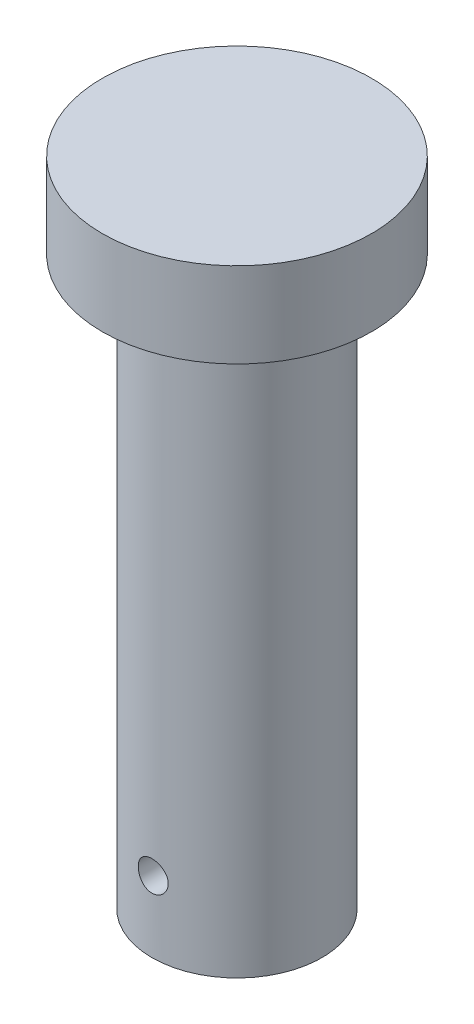
ISO-10303-21;
HEADER;
FILE_DESCRIPTION(('STEP AP214'),'2;1');
FILE_NAME('part.step','',(''),(''),'','','');
FILE_SCHEMA(('AUTOMOTIVE_DESIGN { 1 0 10303 214 1 1 1 1 }'));
ENDSEC;
DATA;
#1=APPLICATION_CONTEXT('core data for automotive mechanical design processes');
#2=APPLICATION_PROTOCOL_DEFINITION('international standard','automotive_design',2000,#1);
#3=PRODUCT_CONTEXT('',#1,'mechanical');
#4=PRODUCT('Part','Part','',(#3));
#5=PRODUCT_RELATED_PRODUCT_CATEGORY('part','',(#4));
#6=PRODUCT_DEFINITION_FORMATION('','',#4);
#7=PRODUCT_DEFINITION_CONTEXT('part definition',#1,'design');
#8=PRODUCT_DEFINITION('design','',#6,#7);
#9=PRODUCT_DEFINITION_SHAPE('','',#8);
#10=(LENGTH_UNIT() NAMED_UNIT(*) SI_UNIT(.MILLI.,.METRE.));
#11=(NAMED_UNIT(*) PLANE_ANGLE_UNIT() SI_UNIT($,.RADIAN.));
#12=(NAMED_UNIT(*) SI_UNIT($,.STERADIAN.) SOLID_ANGLE_UNIT());
#13=UNCERTAINTY_MEASURE_WITH_UNIT(LENGTH_MEASURE(1.E-05),#10,'distance_accuracy_value','');
#14=(GEOMETRIC_REPRESENTATION_CONTEXT(3) GLOBAL_UNCERTAINTY_ASSIGNED_CONTEXT((#13)) GLOBAL_UNIT_ASSIGNED_CONTEXT((#10,
#11,#12)) REPRESENTATION_CONTEXT('',''));
#15=CARTESIAN_POINT('',(0.,0.,0.));
#16=DIRECTION('',(0.,0.,1.));
#17=DIRECTION('',(1.,0.,0.));
#18=AXIS2_PLACEMENT_3D('',#15,#16,#17);
#19=CARTESIAN_POINT('',(0.,-80.,0.));
#20=DIRECTION('',(0.,1.,0.));
#21=DIRECTION('',(0.,0.,1.));
#22=AXIS2_PLACEMENT_3D('',#19,#20,#21);
#23=CYLINDRICAL_SURFACE('',#22,12.);
#24=CARTESIAN_POINT('',(-1.54909249414774,-71.439651241282,11.8995929528944));
#25=CARTESIAN_POINT('',(-1.46816649983692,-71.5265472920139,11.9101271159952));
#26=CARTESIAN_POINT('',(-1.37987067662691,-71.60665176283,11.920779560886));
#27=CARTESIAN_POINT('',(-1.19096698929855,-71.7510107751775,11.9411313791838));
#28=CARTESIAN_POINT('',(-1.09034831677393,-71.8152512512434,11.9508299022659));
#29=CARTESIAN_POINT('',(-0.879591569962719,-71.9259989229328,11.9681863157843));
#30=CARTESIAN_POINT('',(-0.769452483267082,-71.9725042297303,11.9758439888404));
#31=CARTESIAN_POINT('',(-0.542798969972665,-72.0463613139229,11.9882540774579));
#32=CARTESIAN_POINT('',(-0.426286228978256,-72.0737181292611,11.9930072571458));
#33=CARTESIAN_POINT('',(-0.191304867610071,-72.1082886486683,11.9990452280305));
#34=CARTESIAN_POINT('',(-0.0728636721976084,-72.115683283779,12.0003611697295));
#35=CARTESIAN_POINT('',(0.163579686531185,-72.1106179107776,11.9994673839243));
#36=CARTESIAN_POINT('',(0.281581855499137,-72.0981581591452,11.9972577019643));
#37=CARTESIAN_POINT('',(0.512852956654066,-72.0539464199666,11.9895902357434));
#38=CARTESIAN_POINT('',(0.626151341199648,-72.0223437399783,11.984157596016));
#39=CARTESIAN_POINT('',(0.845830591579433,-71.9409181829124,11.9706596479695));
#40=CARTESIAN_POINT('',(0.952211096833096,-71.8910943569893,11.9625942025524));
#41=CARTESIAN_POINT('',(1.15603558135029,-71.7741541038648,11.9446284906715));
#42=CARTESIAN_POINT('',(1.25339616260033,-71.7068946696976,11.9347132502253));
#43=CARTESIAN_POINT('',(1.43553083949792,-71.5571560039648,11.9141792101098));
#44=CARTESIAN_POINT('',(1.52030391742256,-71.4746755429589,11.903560353652));
#45=CARTESIAN_POINT('',(1.67585902911277,-71.2956896044851,11.8826655675487));
#46=CARTESIAN_POINT('',(1.74646854986242,-71.199033439511,11.8723950008192));
#47=CARTESIAN_POINT('',(1.87044180060612,-70.9950811129214,11.8534971747876));
#48=CARTESIAN_POINT('',(1.92380601475656,-70.8877852501225,11.8448698693542));
#49=CARTESIAN_POINT('',(2.01151431419111,-70.6660201415076,11.8302912459855));
#50=CARTESIAN_POINT('',(2.04593618445118,-70.5515824135361,11.8243290034592));
#51=CARTESIAN_POINT('',(2.09501968066684,-70.3184272874579,11.8157320065792));
#52=CARTESIAN_POINT('',(2.10968342092952,-70.1997103486634,11.8130968961928));
#53=CARTESIAN_POINT('',(2.11871692022258,-69.9632469266212,11.8114799379129));
#54=CARTESIAN_POINT('',(2.11338366028772,-69.8455120641688,11.8124446273624));
#55=CARTESIAN_POINT('',(2.08325561735551,-69.6126432622315,11.8177948722257));
#56=CARTESIAN_POINT('',(2.0584611275902,-69.4975092835846,11.8221803760965));
#57=CARTESIAN_POINT('',(1.99027858656701,-69.2734245553988,11.833848597597));
#58=CARTESIAN_POINT('',(1.94694583571914,-69.1644564986891,11.8411226938392));
#59=CARTESIAN_POINT('',(1.84296649096917,-68.9552930922534,11.8577499495437));
#60=CARTESIAN_POINT('',(1.78231845382647,-68.8550984747095,11.8671032822973));
#61=CARTESIAN_POINT('',(1.64448104222243,-68.6648782815651,11.8869920629508));
#62=CARTESIAN_POINT('',(1.56708139314218,-68.5750065405339,11.8975416411458));
#63=CARTESIAN_POINT('',(1.39836371085198,-68.4094266025962,11.918548200363));
#64=CARTESIAN_POINT('',(1.3070447844042,-68.333719315356,11.9290051753971));
#65=CARTESIAN_POINT('',(1.11202988179444,-68.1979008833679,11.9487685549213));
#66=CARTESIAN_POINT('',(1.00822402377809,-68.1379456017718,11.9580630165484));
#67=CARTESIAN_POINT('',(0.791841113361693,-68.0363393748898,11.9743368946069));
#68=CARTESIAN_POINT('',(0.679264562992215,-67.9946873828367,11.9813164434228));
#69=CARTESIAN_POINT('',(0.449451043678538,-67.931200672714,11.9921272392552));
#70=CARTESIAN_POINT('',(0.332257069294338,-67.909214529349,11.9959825208149));
#71=CARTESIAN_POINT('',(0.0957836793156219,-67.8851960254766,12.0002001155731));
#72=CARTESIAN_POINT('',(-0.0234955706163033,-67.8831620870381,12.0005627049931));
#73=CARTESIAN_POINT('',(-0.259264198939206,-67.8990134071118,11.9977715853272));
#74=CARTESIAN_POINT('',(-0.37576989023089,-67.9166647564019,11.9946591673083));
#75=CARTESIAN_POINT('',(-0.604131993889047,-67.9709697728538,11.9853281616923));
#76=CARTESIAN_POINT('',(-0.715988318181915,-68.007623799809,11.9791095152826));
#77=CARTESIAN_POINT('',(-0.932264040617428,-68.0989787746749,11.9642249292619));
#78=CARTESIAN_POINT('',(-1.03666145948587,-68.153730583438,11.9555521025792));
#79=CARTESIAN_POINT('',(-1.23485121673986,-68.2797000369582,11.9367108745469));
#80=CARTESIAN_POINT('',(-1.32864261013072,-68.3509191472298,11.9265423401154));
#81=CARTESIAN_POINT('',(-1.50425038641623,-68.5089093179102,11.9056778449126));
#82=CARTESIAN_POINT('',(-1.58589480253049,-68.5958709365693,11.894976738046));
#83=CARTESIAN_POINT('',(-1.73346690478322,-68.7823282855252,11.8743698634896));
#84=CARTESIAN_POINT('',(-1.79939421593434,-68.8818243147884,11.8644641147797));
#85=CARTESIAN_POINT('',(-1.91379533307425,-69.0909033722494,11.8465506985143));
#86=CARTESIAN_POINT('',(-1.96222229883803,-69.2005124996464,11.8385481441835));
#87=CARTESIAN_POINT('',(-2.0399019229334,-69.4264850079377,11.8254118318194));
#88=CARTESIAN_POINT('',(-2.06915699020643,-69.5428475382689,11.8202777133803));
#89=CARTESIAN_POINT('',(-2.10731550629418,-69.7773632985489,11.8135344512165));
#90=CARTESIAN_POINT('',(-2.11648573697333,-69.8954718087137,11.8118791118723));
#91=CARTESIAN_POINT('',(-2.11497294584302,-70.1315751357604,11.8121501260433));
#92=CARTESIAN_POINT('',(-2.10428770396364,-70.2495699384527,11.8140768800778));
#93=CARTESIAN_POINT('',(-2.06359318169169,-70.4809486374011,11.8212519543766));
#94=CARTESIAN_POINT('',(-2.03376046454907,-70.5943647002482,11.8264699181284));
#95=CARTESIAN_POINT('',(-1.95585286324007,-70.8145059498097,11.8396025400539));
#96=CARTESIAN_POINT('',(-1.90779217478905,-70.9212362681237,11.8475150992222));
#97=CARTESIAN_POINT('',(-1.80965609940814,-71.0984594676406,11.8628373328655));
#98=CARTESIAN_POINT('',(-1.76339332558944,-71.1711305047634,11.8698375306394));
#99=CARTESIAN_POINT('',(-1.66240558808788,-71.3102714347695,11.8844021291091));
#100=CARTESIAN_POINT('',(-1.60768042042514,-71.3767411781134,11.8919665434027));
#101=CARTESIAN_POINT('',(-1.54909249414774,-71.439651241282,11.8995929528944));
#102=B_SPLINE_CURVE_WITH_KNOTS('',3,(#24,#25,#26,#27,#28,#29,#30,#31,#32,#33,#34,#35,#36,#37,
#38,#39,#40,#41,#42,#43,#44,#45,#46,#47,#48,#49,#50,#51,#52,#53,#54,#55,#56,#57,#58,#59,#60,#61,
#62,#63,#64,#65,#66,#67,#68,#69,#70,#71,#72,#73,#74,#75,#76,#77,#78,#79,#80,#81,#82,#83,#84,#85,
#86,#87,#88,#89,#90,#91,#92,#93,#94,#95,#96,#97,#98,#99,#100,#101),.UNSPECIFIED.,.T.,.F.,(4,2,2,
2,2,2,2,2,2,2,2,2,2,2,2,2,2,2,2,2,2,2,2,2,2,2,2,2,2,2,2,2,2,2,2,2,2,2,4),(0.,0.357319150965292,
0.714953982800796,1.07262689272993,1.4302056639772,1.78453239511077,2.13885454907583,
2.49044808416091,2.84205993068699,3.19665234597394,3.55127341512052,3.90998162986505,
4.26867977311801,4.62589375009981,4.9830694987653,5.33496188687607,5.68684897295088,
6.03769360522019,6.38856748916385,6.74413157377028,7.09971848550304,7.45870157141783,
7.81766412437413,8.17383829239184,8.52998429195385,8.88194307638771,9.23390852499,
9.58687164624301,9.93986619169897,10.297460461878,10.6550632628843,11.0136162313671,
11.3721241391693,11.7258404400615,12.0795962928791,12.4301360548115,12.7804033794833,
13.0390851982604,13.2977732533476),.UNSPECIFIED.);
#103=CARTESIAN_POINT('',(-1.54909249414774,-71.439651241282,11.8995929528944));
#104=VERTEX_POINT('',#103);
#105=EDGE_CURVE('E51',#104,#104,#102,.T.);
#106=ORIENTED_EDGE('',*,*,#105,.F.);
#107=EDGE_LOOP('',(#106));
#108=FACE_BOUND('',#107,.T.);
#109=CARTESIAN_POINT('',(0.,-80.,0.));
#110=DIRECTION('',(0.,-1.,0.));
#111=DIRECTION('',(0.,0.,-1.));
#112=AXIS2_PLACEMENT_3D('',#109,#110,#111);
#113=CIRCLE('',#112,12.);
#114=CARTESIAN_POINT('',(0.,-80.,-12.));
#115=VERTEX_POINT('',#114);
#116=EDGE_CURVE('E82',#115,#115,#113,.T.);
#117=ORIENTED_EDGE('',*,*,#116,.F.);
#118=EDGE_LOOP('',(#117));
#119=FACE_BOUND('',#118,.T.);
#120=CARTESIAN_POINT('',(0.,0.,0.));
#121=DIRECTION('',(0.,1.,0.));
#122=DIRECTION('',(0.,0.,1.));
#123=AXIS2_PLACEMENT_3D('',#120,#121,#122);
#124=CIRCLE('',#123,12.);
#125=CARTESIAN_POINT('',(0.,0.,12.));
#126=VERTEX_POINT('',#125);
#127=EDGE_CURVE('E10',#126,#126,#124,.F.);
#128=ORIENTED_EDGE('',*,*,#127,.T.);
#129=EDGE_LOOP('',(#128));
#130=FACE_BOUND('',#129,.T.);
#131=CARTESIAN_POINT('',(-1.73729029022469,-71.6339214418128,-11.873576649329));
#132=CARTESIAN_POINT('',(-1.82868060768877,-71.5365215394864,-11.8602050659851));
#133=CARTESIAN_POINT('',(-1.91192505431367,-71.4313775364374,-11.8469460338405));
#134=CARTESIAN_POINT('',(-2.0597730712612,-71.2084442657098,-11.8221395864496));
#135=CARTESIAN_POINT('',(-2.12436275893894,-71.0906456696169,-11.8105934490104));
#136=CARTESIAN_POINT('',(-2.23299683781365,-70.8456130507244,-11.790538247505));
#137=CARTESIAN_POINT('',(-2.27703351636797,-70.7183755066256,-11.7820303238279));
#138=CARTESIAN_POINT('',(-2.34314602830769,-70.458144404635,-11.76906181622));
#139=CARTESIAN_POINT('',(-2.36522763543309,-70.3251523696633,-11.7646001682275));
#140=CARTESIAN_POINT('',(-2.38660047159272,-70.0589711173365,-11.760283032818));
#141=CARTESIAN_POINT('',(-2.38617633588918,-69.9258056553184,-11.7603700176005));
#142=CARTESIAN_POINT('',(-2.36325814431466,-69.6614682486453,-11.7649965509005));
#143=CARTESIAN_POINT('',(-2.34076409275259,-69.5302963036011,-11.7695360985487));
#144=CARTESIAN_POINT('',(-2.27462873164534,-69.2745009682326,-11.7824945845516));
#145=CARTESIAN_POINT('',(-2.23112235193762,-69.1498413435343,-11.7908887539056));
#146=CARTESIAN_POINT('',(-2.12431218486182,-68.9095636461753,-11.8105982757206));
#147=CARTESIAN_POINT('',(-2.06100663896791,-68.7939463777808,-11.8219138876431));
#148=CARTESIAN_POINT('',(-1.91532402516582,-68.5732302688369,-11.8463939318317));
#149=CARTESIAN_POINT('',(-1.83268645440867,-68.4683060657079,-11.859582552389));
#150=CARTESIAN_POINT('',(-1.65110676342341,-68.2736967252107,-11.8862209677872));
#151=CARTESIAN_POINT('',(-1.55216326455733,-68.1840128776916,-11.8996707846269));
#152=CARTESIAN_POINT('',(-1.33931219701858,-68.0213409939087,-11.9255127577848));
#153=CARTESIAN_POINT('',(-1.2252372009838,-67.9485693821022,-11.9378900537514));
#154=CARTESIAN_POINT('',(-0.986223547201478,-67.8232758177879,-11.9600061165621));
#155=CARTESIAN_POINT('',(-0.86128563058501,-67.7707524851522,-11.9697450632233));
#156=CARTESIAN_POINT('',(-0.605333006229454,-67.6879820497048,-11.9854011798583));
#157=CARTESIAN_POINT('',(-0.474388179355351,-67.6575258618888,-11.9913541539509));
#158=CARTESIAN_POINT('',(-0.209124710994743,-67.6190559070534,-11.9989107493917));
#159=CARTESIAN_POINT('',(-0.0748064708542611,-67.6110394829441,-12.0005148856845));
#160=CARTESIAN_POINT('',(0.190932911502853,-67.6176488541641,-11.9992042722375));
#161=CARTESIAN_POINT('',(0.322364228377331,-67.6318886336737,-11.9963665614684));
#162=CARTESIAN_POINT('',(0.580920335146987,-67.681837989024,-11.9866290187046));
#163=CARTESIAN_POINT('',(0.708045100650566,-67.7175476864453,-11.9797291637065));
#164=CARTESIAN_POINT('',(0.954565957499131,-67.8093777251565,-11.9626125034093));
#165=CARTESIAN_POINT('',(1.07395550451654,-67.8655150902027,-11.9523929323309));
#166=CARTESIAN_POINT('',(1.30170999935352,-67.9965680999917,-11.9297387443338));
#167=CARTESIAN_POINT('',(1.4100737382214,-68.0714858008376,-11.9173038849249));
#168=CARTESIAN_POINT('',(1.61473450669401,-68.2395154406671,-11.8913193190564));
#169=CARTESIAN_POINT('',(1.71078650914678,-68.3329234960917,-11.877753882125));
#170=CARTESIAN_POINT('',(1.88597195371952,-68.5345275135205,-11.8512016062542));
#171=CARTESIAN_POINT('',(1.9651043109154,-68.6427244230892,-11.8382148044604));
#172=CARTESIAN_POINT('',(2.10485799832551,-68.8719902120451,-11.8141721260405));
#173=CARTESIAN_POINT('',(2.16531291063381,-68.9931625467597,-11.8031339644632));
#174=CARTESIAN_POINT('',(2.2649595320027,-69.2441987578395,-11.7844196626434));
#175=CARTESIAN_POINT('',(2.30415338821285,-69.374061755048,-11.7767431829205));
#176=CARTESIAN_POINT('',(2.35968098720713,-69.6370107471987,-11.765742854652));
#177=CARTESIAN_POINT('',(2.37630360575324,-69.7700334036972,-11.7623640390475));
#178=CARTESIAN_POINT('',(2.38709177738534,-70.0370176666684,-11.7601797112237));
#179=CARTESIAN_POINT('',(2.3812592911599,-70.1709791901436,-11.7613737997169));
#180=CARTESIAN_POINT('',(2.34756237038345,-70.4341401447528,-11.7681448103194));
#181=CARTESIAN_POINT('',(2.31999559522212,-70.5633794063697,-11.7736625126706));
#182=CARTESIAN_POINT('',(2.24404898556013,-70.8153667372646,-11.7883725669373));
#183=CARTESIAN_POINT('',(2.19566804108723,-70.9381144599714,-11.797565114822));
#184=CARTESIAN_POINT('',(2.07905286978815,-71.1747224747678,-11.8186742361753));
#185=CARTESIAN_POINT('',(2.01066684497797,-71.2885060414699,-11.8306114823484));
#186=CARTESIAN_POINT('',(1.85609709801537,-71.5031000070622,-11.8558432252315));
#187=CARTESIAN_POINT('',(1.76991140959504,-71.6039089706939,-11.8691378718067));
#188=CARTESIAN_POINT('',(1.58047897569849,-71.7914305192291,-11.895854997186));
#189=CARTESIAN_POINT('',(1.47697336956414,-71.8778820663827,-11.9092759478324));
#190=CARTESIAN_POINT('',(1.25674846853078,-72.0322011072041,-11.9345233491933));
#191=CARTESIAN_POINT('',(1.14002922625722,-72.100068674882,-11.9463498062577));
#192=CARTESIAN_POINT('',(0.896722995666119,-72.2151573377515,-11.9670698664223));
#193=CARTESIAN_POINT('',(0.770146865131211,-72.262400782569,-11.9759666417315));
#194=CARTESIAN_POINT('',(0.510639510479016,-72.3348595276072,-11.9898337052006));
#195=CARTESIAN_POINT('',(0.377709244423413,-72.3600781377001,-11.9948045833301));
#196=CARTESIAN_POINT('',(0.111797718194024,-72.3874235925329,-12.0002029923366));
#197=CARTESIAN_POINT('',(-0.0211406481615009,-72.38995286979,-12.0007096996858));
#198=CARTESIAN_POINT('',(-0.285548848009527,-72.3728881531299,-11.9973306693309));
#199=CARTESIAN_POINT('',(-0.417018532036588,-72.3532919278802,-11.9934444886087));
#200=CARTESIAN_POINT('',(-0.673728749249481,-72.2928362420013,-11.9817566789758));
#201=CARTESIAN_POINT('',(-0.799008567759283,-72.2521371648584,-11.9739845989351));
#202=CARTESIAN_POINT('',(-1.04091171036596,-72.1508116442598,-11.9553842474229));
#203=CARTESIAN_POINT('',(-1.15754055335643,-72.0901980416627,-11.9445579459433));
#204=CARTESIAN_POINT('',(-1.3543508069,-71.96638631673,-11.9236426706216));
#205=CARTESIAN_POINT('',(-1.43685926188869,-71.9067805025416,-11.9139278895786));
#206=CARTESIAN_POINT('',(-1.59357909418225,-71.7775833826131,-11.8939792711876));
#207=CARTESIAN_POINT('',(-1.66779016618535,-71.7079917096589,-11.8837454147605));
#208=CARTESIAN_POINT('',(-1.73729029022469,-71.6339214418128,-11.873576649329));
#209=B_SPLINE_CURVE_WITH_KNOTS('',3,(#131,#132,#133,#134,#135,#136,#137,#138,#139,#140,#141,
#142,#143,#144,#145,#146,#147,#148,#149,#150,#151,#152,#153,#154,#155,#156,#157,#158,#159,#160,
#161,#162,#163,#164,#165,#166,#167,#168,#169,#170,#171,#172,#173,#174,#175,#176,#177,#178,#179,
#180,#181,#182,#183,#184,#185,#186,#187,#188,#189,#190,#191,#192,#193,#194,#195,#196,#197,#198,
#199,#200,#201,#202,#203,#204,#205,#206,#207,#208),.UNSPECIFIED.,.T.,.F.,(4,2,2,2,2,2,2,2,2,2,2,
2,2,2,2,2,2,2,2,2,2,2,2,2,2,2,2,2,2,2,2,2,2,2,2,2,2,2,4),(0.,0.402327927839757,
0.804954496280781,1.20773203157173,1.61040361647422,2.00798375077699,2.4055638074565,
2.80062409588343,3.19571948281407,3.59648134119282,3.99727710069232,4.4029495564946,
4.80859435666833,5.2103435601311,5.61204519050426,6.00685656813055,6.40167018152974,
6.79681357616653,7.19200025068168,7.59411946559124,7.99626445752326,8.40189562199758,
8.80748581423674,9.20783456360213,9.60814835693347,10.0030729761224,10.3980186583528,
10.7960425569759,11.1941104474763,11.598769349368,12.0034266396965,12.4076443221912,
12.8118012487607,13.2087753015993,13.6057893924093,13.9998294332366,14.3936158946018,
14.6995652904119,15.0055259399122),.UNSPECIFIED.);
#210=CARTESIAN_POINT('',(-1.73729029022469,-71.6339214418128,-11.873576649329));
#211=VERTEX_POINT('',#210);
#212=EDGE_CURVE('E35',#211,#211,#209,.T.);
#213=ORIENTED_EDGE('',*,*,#212,.F.);
#214=EDGE_LOOP('',(#213));
#215=FACE_BOUND('',#214,.T.);
#216=ADVANCED_FACE('F31',(#108,#119,#130,#215),#23,.T.);
#217=CARTESIAN_POINT('',(0.,0.,0.));
#218=DIRECTION('',(0.,1.,0.));
#219=DIRECTION('',(0.,0.,1.));
#220=AXIS2_PLACEMENT_3D('',#217,#218,#219);
#221=PLANE('',#220);
#222=CARTESIAN_POINT('',(0.,0.,0.));
#223=DIRECTION('',(0.,1.,0.));
#224=DIRECTION('',(0.,0.,1.));
#225=AXIS2_PLACEMENT_3D('',#222,#223,#224);
#226=CIRCLE('',#225,19.);
#227=CARTESIAN_POINT('',(0.,0.,19.));
#228=VERTEX_POINT('',#227);
#229=EDGE_CURVE('E48',#228,#228,#226,.T.);
#230=ORIENTED_EDGE('',*,*,#229,.F.);
#231=EDGE_LOOP('',(#230));
#232=FACE_BOUND('',#231,.T.);
#233=ORIENTED_EDGE('',*,*,#127,.F.);
#234=EDGE_LOOP('',(#233));
#235=FACE_BOUND('',#234,.T.);
#236=ADVANCED_FACE('F73',(#232,#235),#221,.F.);
#237=CARTESIAN_POINT('',(0.,12.,0.));
#238=DIRECTION('',(0.,-1.,0.));
#239=DIRECTION('',(0.,0.,-1.));
#240=AXIS2_PLACEMENT_3D('',#237,#238,#239);
#241=CYLINDRICAL_SURFACE('',#240,19.);
#242=CARTESIAN_POINT('',(0.,12.,0.));
#243=DIRECTION('',(0.,1.,0.));
#244=DIRECTION('',(0.,0.,1.));
#245=AXIS2_PLACEMENT_3D('',#242,#243,#244);
#246=CIRCLE('',#245,19.);
#247=CARTESIAN_POINT('',(0.,12.,19.));
#248=VERTEX_POINT('',#247);
#249=EDGE_CURVE('E43',#248,#248,#246,.T.);
#250=ORIENTED_EDGE('',*,*,#249,.F.);
#251=EDGE_LOOP('',(#250));
#252=FACE_BOUND('',#251,.T.);
#253=ORIENTED_EDGE('',*,*,#229,.T.);
#254=EDGE_LOOP('',(#253));
#255=FACE_BOUND('',#254,.T.);
#256=ADVANCED_FACE('F33',(#252,#255),#241,.T.);
#257=CARTESIAN_POINT('',(0.,12.,0.));
#258=DIRECTION('',(0.,1.,0.));
#259=DIRECTION('',(0.,0.,1.));
#260=AXIS2_PLACEMENT_3D('',#257,#258,#259);
#261=PLANE('',#260);
#262=ORIENTED_EDGE('',*,*,#249,.T.);
#263=EDGE_LOOP('',(#262));
#264=FACE_BOUND('',#263,.T.);
#265=ADVANCED_FACE('F65',(#264),#261,.T.);
#266=CARTESIAN_POINT('',(0.,-80.,0.));
#267=DIRECTION('',(0.,-1.,0.));
#268=DIRECTION('',(0.,0.,-1.));
#269=AXIS2_PLACEMENT_3D('',#266,#267,#268);
#270=PLANE('',#269);
#271=ORIENTED_EDGE('',*,*,#116,.T.);
#272=EDGE_LOOP('',(#271));
#273=FACE_BOUND('',#272,.T.);
#274=ADVANCED_FACE('F61',(#273),#270,.T.);
#275=CARTESIAN_POINT('',(0.,-70.,22.));
#276=DIRECTION('',(0.,0.,-1.));
#277=DIRECTION('',(-1.,0.,0.));
#278=AXIS2_PLACEMENT_3D('',#275,#276,#277);
#279=CONICAL_SURFACE('',#278,2.00000000000001,0.0113631472642906);
#280=ORIENTED_EDGE('',*,*,#105,.T.);
#281=EDGE_LOOP('',(#280));
#282=FACE_BOUND('',#281,.T.);
#283=ORIENTED_EDGE('',*,*,#212,.T.);
#284=EDGE_LOOP('',(#283));
#285=FACE_BOUND('',#284,.T.);
#286=ADVANCED_FACE('F58',(#282,#285),#279,.F.);
#287=CLOSED_SHELL('',(#216,#236,#256,#265,#274,#286));
#288=MANIFOLD_SOLID_BREP('B2',#287);
#289=ADVANCED_BREP_SHAPE_REPRESENTATION('',(#18,#288),#14);
#290=SHAPE_DEFINITION_REPRESENTATION(#9,#289);
ENDSEC;
END-ISO-10303-21;
